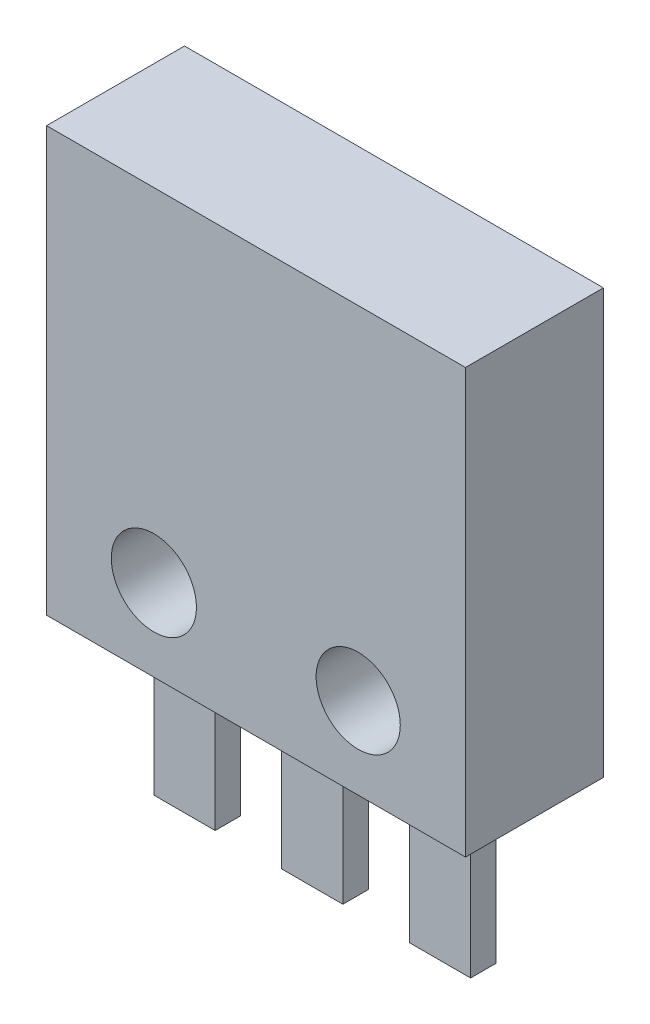
ISO-10303-21;
HEADER;
FILE_DESCRIPTION(('STEP AP214'),'2;1');
FILE_NAME('part.step','',(''),(''),'','','');
FILE_SCHEMA(('AUTOMOTIVE_DESIGN { 1 0 10303 214 1 1 1 1 }'));
ENDSEC;
DATA;
#1=APPLICATION_CONTEXT('core data for automotive mechanical design processes');
#2=APPLICATION_PROTOCOL_DEFINITION('international standard','automotive_design',2000,#1);
#3=PRODUCT_CONTEXT('',#1,'mechanical');
#4=PRODUCT('Part','Part','',(#3));
#5=PRODUCT_RELATED_PRODUCT_CATEGORY('part','',(#4));
#6=PRODUCT_DEFINITION_FORMATION('','',#4);
#7=PRODUCT_DEFINITION_CONTEXT('part definition',#1,'design');
#8=PRODUCT_DEFINITION('design','',#6,#7);
#9=PRODUCT_DEFINITION_SHAPE('','',#8);
#10=(LENGTH_UNIT() NAMED_UNIT(*) SI_UNIT(.MILLI.,.METRE.));
#11=(NAMED_UNIT(*) PLANE_ANGLE_UNIT() SI_UNIT($,.RADIAN.));
#12=(NAMED_UNIT(*) SI_UNIT($,.STERADIAN.) SOLID_ANGLE_UNIT());
#13=UNCERTAINTY_MEASURE_WITH_UNIT(LENGTH_MEASURE(1.E-05),#10,'distance_accuracy_value','');
#14=(GEOMETRIC_REPRESENTATION_CONTEXT(3) GLOBAL_UNCERTAINTY_ASSIGNED_CONTEXT((#13)) GLOBAL_UNIT_ASSIGNED_CONTEXT((#10,
#11,#12)) REPRESENTATION_CONTEXT('',''));
#15=CARTESIAN_POINT('',(0.,0.,0.));
#16=DIRECTION('',(0.,0.,1.));
#17=DIRECTION('',(1.,0.,0.));
#18=AXIS2_PLACEMENT_3D('',#15,#16,#17);
#19=CARTESIAN_POINT('',(0.,0.,1.35));
#20=DIRECTION('',(0.,0.,1.));
#21=DIRECTION('',(1.,0.,0.));
#22=AXIS2_PLACEMENT_3D('',#19,#20,#21);
#23=PLANE('',#22);
#24=CARTESIAN_POINT('',(-2.,-2.55,1.35));
#25=DIRECTION('',(0.,0.,1.));
#26=DIRECTION('',(1.,0.,0.));
#27=AXIS2_PLACEMENT_3D('',#24,#25,#26);
#28=CIRCLE('',#27,0.833443518886286);
#29=CARTESIAN_POINT('',(-1.16655648111371,-2.55,1.35));
#30=VERTEX_POINT('',#29);
#31=EDGE_CURVE('E241',#30,#30,#28,.T.);
#32=ORIENTED_EDGE('',*,*,#31,.F.);
#33=EDGE_LOOP('',(#32));
#34=FACE_BOUND('',#33,.T.);
#35=DIRECTION('',(0.,1.,0.));
#36=VECTOR('',#35,1.);
#37=CARTESIAN_POINT('',(4.1,4.15,1.35));
#38=LINE('',#37,#36);
#39=CARTESIAN_POINT('',(4.1,-4.15,1.35));
#40=VERTEX_POINT('',#39);
#41=CARTESIAN_POINT('',(4.1,4.15,1.35));
#42=VERTEX_POINT('',#41);
#43=EDGE_CURVE('E247',#40,#42,#38,.T.);
#44=ORIENTED_EDGE('',*,*,#43,.T.);
#45=DIRECTION('',(-1.,0.,0.));
#46=VECTOR('',#45,1.);
#47=CARTESIAN_POINT('',(-4.1,4.15,1.35));
#48=LINE('',#47,#46);
#49=CARTESIAN_POINT('',(-4.1,4.15,1.35));
#50=VERTEX_POINT('',#49);
#51=EDGE_CURVE('E250',#42,#50,#48,.T.);
#52=ORIENTED_EDGE('',*,*,#51,.T.);
#53=DIRECTION('',(0.,-1.,0.));
#54=VECTOR('',#53,1.);
#55=CARTESIAN_POINT('',(-4.1,4.15,1.35));
#56=LINE('',#55,#54);
#57=CARTESIAN_POINT('',(-4.1,-4.15,1.35));
#58=VERTEX_POINT('',#57);
#59=EDGE_CURVE('E253',#50,#58,#56,.T.);
#60=ORIENTED_EDGE('',*,*,#59,.T.);
#61=DIRECTION('',(1.,0.,0.));
#62=VECTOR('',#61,1.);
#63=CARTESIAN_POINT('',(-4.1,-4.15,1.35));
#64=LINE('',#63,#62);
#65=EDGE_CURVE('E255',#58,#40,#64,.T.);
#66=ORIENTED_EDGE('',*,*,#65,.T.);
#67=EDGE_LOOP('',(#44,#52,#60,#66));
#68=FACE_BOUND('',#67,.T.);
#69=CARTESIAN_POINT('',(2.,-2.55,1.35));
#70=DIRECTION('',(0.,0.,1.));
#71=DIRECTION('',(1.,0.,0.));
#72=AXIS2_PLACEMENT_3D('',#69,#70,#71);
#73=CIRCLE('',#72,0.82380316392483);
#74=CARTESIAN_POINT('',(2.82380316392483,-2.55,1.35));
#75=VERTEX_POINT('',#74);
#76=EDGE_CURVE('E235',#75,#75,#73,.T.);
#77=ORIENTED_EDGE('',*,*,#76,.F.);
#78=EDGE_LOOP('',(#77));
#79=FACE_BOUND('',#78,.T.);
#80=ADVANCED_FACE('F33',(#34,#68,#79),#23,.T.);
#81=CARTESIAN_POINT('',(0.,0.,-1.35));
#82=DIRECTION('',(0.,0.,1.));
#83=DIRECTION('',(1.,0.,0.));
#84=AXIS2_PLACEMENT_3D('',#81,#82,#83);
#85=PLANE('',#84);
#86=DIRECTION('',(0.,1.,0.));
#87=VECTOR('',#86,1.);
#88=CARTESIAN_POINT('',(4.1,4.15,-1.35));
#89=LINE('',#88,#87);
#90=CARTESIAN_POINT('',(4.1,-4.15,-1.35));
#91=VERTEX_POINT('',#90);
#92=CARTESIAN_POINT('',(4.1,4.15,-1.35));
#93=VERTEX_POINT('',#92);
#94=EDGE_CURVE('E244',#91,#93,#89,.T.);
#95=ORIENTED_EDGE('',*,*,#94,.F.);
#96=DIRECTION('',(1.,0.,0.));
#97=VECTOR('',#96,1.);
#98=CARTESIAN_POINT('',(-4.1,-4.15,-1.35));
#99=LINE('',#98,#97);
#100=CARTESIAN_POINT('',(-4.1,-4.15,-1.35));
#101=VERTEX_POINT('',#100);
#102=EDGE_CURVE('E251',#101,#91,#99,.T.);
#103=ORIENTED_EDGE('',*,*,#102,.F.);
#104=DIRECTION('',(0.,-1.,0.));
#105=VECTOR('',#104,1.);
#106=CARTESIAN_POINT('',(-4.1,4.15,-1.35));
#107=LINE('',#106,#105);
#108=CARTESIAN_POINT('',(-4.1,4.15,-1.35));
#109=VERTEX_POINT('',#108);
#110=EDGE_CURVE('E262',#109,#101,#107,.T.);
#111=ORIENTED_EDGE('',*,*,#110,.F.);
#112=DIRECTION('',(-1.,0.,0.));
#113=VECTOR('',#112,1.);
#114=CARTESIAN_POINT('',(-4.1,4.15,-1.35));
#115=LINE('',#114,#113);
#116=EDGE_CURVE('E260',#93,#109,#115,.T.);
#117=ORIENTED_EDGE('',*,*,#116,.F.);
#118=EDGE_LOOP('',(#95,#103,#111,#117));
#119=FACE_BOUND('',#118,.T.);
#120=CARTESIAN_POINT('',(-2.,-2.55,-1.35));
#121=DIRECTION('',(0.,0.,1.));
#122=DIRECTION('',(1.,0.,0.));
#123=AXIS2_PLACEMENT_3D('',#120,#121,#122);
#124=CIRCLE('',#123,0.833443518886286);
#125=CARTESIAN_POINT('',(-1.16655648111371,-2.55,-1.35));
#126=VERTEX_POINT('',#125);
#127=EDGE_CURVE('E238',#126,#126,#124,.T.);
#128=ORIENTED_EDGE('',*,*,#127,.T.);
#129=EDGE_LOOP('',(#128));
#130=FACE_BOUND('',#129,.T.);
#131=CARTESIAN_POINT('',(2.,-2.55,-1.35));
#132=DIRECTION('',(0.,0.,1.));
#133=DIRECTION('',(1.,0.,0.));
#134=AXIS2_PLACEMENT_3D('',#131,#132,#133);
#135=CIRCLE('',#134,0.82380316392483);
#136=CARTESIAN_POINT('',(2.82380316392483,-2.55,-1.35));
#137=VERTEX_POINT('',#136);
#138=EDGE_CURVE('E234',#137,#137,#135,.T.);
#139=ORIENTED_EDGE('',*,*,#138,.T.);
#140=EDGE_LOOP('',(#139));
#141=FACE_BOUND('',#140,.T.);
#142=ADVANCED_FACE('F280',(#119,#130,#141),#85,.F.);
#143=CARTESIAN_POINT('',(4.1,4.15,1.35));
#144=DIRECTION('',(-1.,0.,0.));
#145=DIRECTION('',(0.,0.,1.));
#146=AXIS2_PLACEMENT_3D('',#143,#144,#145);
#147=PLANE('',#146);
#148=ORIENTED_EDGE('',*,*,#94,.T.);
#149=DIRECTION('',(0.,0.,-1.));
#150=VECTOR('',#149,1.);
#151=CARTESIAN_POINT('',(4.1,4.15,1.35));
#152=LINE('',#151,#150);
#153=EDGE_CURVE('E11',#42,#93,#152,.T.);
#154=ORIENTED_EDGE('',*,*,#153,.F.);
#155=ORIENTED_EDGE('',*,*,#43,.F.);
#156=DIRECTION('',(0.,0.,-1.));
#157=VECTOR('',#156,1.);
#158=CARTESIAN_POINT('',(4.1,-4.15,1.35));
#159=LINE('',#158,#157);
#160=EDGE_CURVE('E257',#40,#91,#159,.T.);
#161=ORIENTED_EDGE('',*,*,#160,.T.);
#162=EDGE_LOOP('',(#148,#154,#155,#161));
#163=FACE_BOUND('',#162,.T.);
#164=ADVANCED_FACE('F35',(#163),#147,.F.);
#165=CARTESIAN_POINT('',(-4.1,4.15,1.35));
#166=DIRECTION('',(0.,-1.,0.));
#167=DIRECTION('',(0.,0.,-1.));
#168=AXIS2_PLACEMENT_3D('',#165,#166,#167);
#169=PLANE('',#168);
#170=ORIENTED_EDGE('',*,*,#116,.T.);
#171=DIRECTION('',(0.,0.,-1.));
#172=VECTOR('',#171,1.);
#173=CARTESIAN_POINT('',(-4.1,4.15,1.35));
#174=LINE('',#173,#172);
#175=EDGE_CURVE('E41',#50,#109,#174,.T.);
#176=ORIENTED_EDGE('',*,*,#175,.F.);
#177=ORIENTED_EDGE('',*,*,#51,.F.);
#178=ORIENTED_EDGE('',*,*,#153,.T.);
#179=EDGE_LOOP('',(#170,#176,#177,#178));
#180=FACE_BOUND('',#179,.T.);
#181=ADVANCED_FACE('F291',(#180),#169,.F.);
#182=CARTESIAN_POINT('',(-4.1,4.15,1.35));
#183=DIRECTION('',(1.,0.,0.));
#184=DIRECTION('',(0.,0.,-1.));
#185=AXIS2_PLACEMENT_3D('',#182,#183,#184);
#186=PLANE('',#185);
#187=ORIENTED_EDGE('',*,*,#110,.T.);
#188=DIRECTION('',(0.,0.,-1.));
#189=VECTOR('',#188,1.);
#190=CARTESIAN_POINT('',(-4.1,-4.15,1.35));
#191=LINE('',#190,#189);
#192=EDGE_CURVE('E267',#58,#101,#191,.T.);
#193=ORIENTED_EDGE('',*,*,#192,.F.);
#194=ORIENTED_EDGE('',*,*,#59,.F.);
#195=ORIENTED_EDGE('',*,*,#175,.T.);
#196=EDGE_LOOP('',(#187,#193,#194,#195));
#197=FACE_BOUND('',#196,.T.);
#198=ADVANCED_FACE('F274',(#197),#186,.F.);
#199=CARTESIAN_POINT('',(-4.1,-4.15,1.35));
#200=DIRECTION('',(0.,1.,0.));
#201=DIRECTION('',(0.,0.,1.));
#202=AXIS2_PLACEMENT_3D('',#199,#200,#201);
#203=PLANE('',#202);
#204=DIRECTION('',(0.,0.,-1.));
#205=VECTOR('',#204,1.);
#206=CARTESIAN_POINT('',(-3.1,-4.15,0.25));
#207=LINE('',#206,#205);
#208=CARTESIAN_POINT('',(-3.1,-4.15,0.25));
#209=VERTEX_POINT('',#208);
#210=CARTESIAN_POINT('',(-3.1,-4.15,-0.25));
#211=VERTEX_POINT('',#210);
#212=EDGE_CURVE('E48',#209,#211,#207,.T.);
#213=ORIENTED_EDGE('',*,*,#212,.F.);
#214=DIRECTION('',(-1.,0.,0.));
#215=VECTOR('',#214,1.);
#216=CARTESIAN_POINT('',(-3.1,-4.15,0.25));
#217=LINE('',#216,#215);
#218=CARTESIAN_POINT('',(-1.9,-4.15,0.25));
#219=VERTEX_POINT('',#218);
#220=EDGE_CURVE('E52',#219,#209,#217,.T.);
#221=ORIENTED_EDGE('',*,*,#220,.F.);
#222=DIRECTION('',(0.,0.,-1.));
#223=VECTOR('',#222,1.);
#224=CARTESIAN_POINT('',(-1.9,-4.15,0.25));
#225=LINE('',#224,#223);
#226=CARTESIAN_POINT('',(-1.9,-4.15,-0.25));
#227=VERTEX_POINT('',#226);
#228=EDGE_CURVE('E170',#219,#227,#225,.T.);
#229=ORIENTED_EDGE('',*,*,#228,.T.);
#230=DIRECTION('',(-1.,0.,0.));
#231=VECTOR('',#230,1.);
#232=CARTESIAN_POINT('',(-3.1,-4.15,-0.25));
#233=LINE('',#232,#231);
#234=EDGE_CURVE('E160',#227,#211,#233,.T.);
#235=ORIENTED_EDGE('',*,*,#234,.T.);
#236=EDGE_LOOP('',(#213,#221,#229,#235));
#237=FACE_BOUND('',#236,.T.);
#238=DIRECTION('',(0.,0.,-1.));
#239=VECTOR('',#238,1.);
#240=CARTESIAN_POINT('',(1.9,-4.15,0.25));
#241=LINE('',#240,#239);
#242=CARTESIAN_POINT('',(1.9,-4.15,0.25));
#243=VERTEX_POINT('',#242);
#244=CARTESIAN_POINT('',(1.9,-4.15,-0.25));
#245=VERTEX_POINT('',#244);
#246=EDGE_CURVE('E185',#243,#245,#241,.T.);
#247=ORIENTED_EDGE('',*,*,#246,.F.);
#248=DIRECTION('',(-1.,0.,0.));
#249=VECTOR('',#248,1.);
#250=CARTESIAN_POINT('',(1.9,-4.15,0.25));
#251=LINE('',#250,#249);
#252=CARTESIAN_POINT('',(3.1,-4.15,0.25));
#253=VERTEX_POINT('',#252);
#254=EDGE_CURVE('E183',#253,#243,#251,.T.);
#255=ORIENTED_EDGE('',*,*,#254,.F.);
#256=DIRECTION('',(0.,0.,-1.));
#257=VECTOR('',#256,1.);
#258=CARTESIAN_POINT('',(3.1,-4.15,0.25));
#259=LINE('',#258,#257);
#260=CARTESIAN_POINT('',(3.1,-4.15,-0.25));
#261=VERTEX_POINT('',#260);
#262=EDGE_CURVE('E194',#253,#261,#259,.T.);
#263=ORIENTED_EDGE('',*,*,#262,.T.);
#264=DIRECTION('',(-1.,0.,0.));
#265=VECTOR('',#264,1.);
#266=CARTESIAN_POINT('',(1.9,-4.15,-0.25));
#267=LINE('',#266,#265);
#268=EDGE_CURVE('E178',#261,#245,#267,.T.);
#269=ORIENTED_EDGE('',*,*,#268,.T.);
#270=EDGE_LOOP('',(#247,#255,#263,#269));
#271=FACE_BOUND('',#270,.T.);
#272=DIRECTION('',(0.,0.,-1.));
#273=VECTOR('',#272,1.);
#274=CARTESIAN_POINT('',(-0.6,-4.15,0.25));
#275=LINE('',#274,#273);
#276=CARTESIAN_POINT('',(-0.6,-4.15,0.25));
#277=VERTEX_POINT('',#276);
#278=CARTESIAN_POINT('',(-0.6,-4.15,-0.25));
#279=VERTEX_POINT('',#278);
#280=EDGE_CURVE('E215',#277,#279,#275,.T.);
#281=ORIENTED_EDGE('',*,*,#280,.F.);
#282=DIRECTION('',(-1.,0.,0.));
#283=VECTOR('',#282,1.);
#284=CARTESIAN_POINT('',(-0.6,-4.15,0.25));
#285=LINE('',#284,#283);
#286=CARTESIAN_POINT('',(0.6,-4.15,0.25));
#287=VERTEX_POINT('',#286);
#288=EDGE_CURVE('E212',#287,#277,#285,.T.);
#289=ORIENTED_EDGE('',*,*,#288,.F.);
#290=DIRECTION('',(0.,0.,-1.));
#291=VECTOR('',#290,1.);
#292=CARTESIAN_POINT('',(0.6,-4.15,0.25));
#293=LINE('',#292,#291);
#294=CARTESIAN_POINT('',(0.6,-4.15,-0.25));
#295=VERTEX_POINT('',#294);
#296=EDGE_CURVE('E226',#287,#295,#293,.T.);
#297=ORIENTED_EDGE('',*,*,#296,.T.);
#298=DIRECTION('',(-1.,0.,0.));
#299=VECTOR('',#298,1.);
#300=CARTESIAN_POINT('',(-0.6,-4.15,-0.25));
#301=LINE('',#300,#299);
#302=EDGE_CURVE('E207',#295,#279,#301,.T.);
#303=ORIENTED_EDGE('',*,*,#302,.T.);
#304=EDGE_LOOP('',(#281,#289,#297,#303));
#305=FACE_BOUND('',#304,.T.);
#306=ORIENTED_EDGE('',*,*,#102,.T.);
#307=ORIENTED_EDGE('',*,*,#160,.F.);
#308=ORIENTED_EDGE('',*,*,#65,.F.);
#309=ORIENTED_EDGE('',*,*,#192,.T.);
#310=EDGE_LOOP('',(#306,#307,#308,#309));
#311=FACE_BOUND('',#310,.T.);
#312=ADVANCED_FACE('F284',(#237,#271,#305,#311),#203,.F.);
#313=CARTESIAN_POINT('',(-2.,-2.55,1.35));
#314=DIRECTION('',(0.,0.,-1.));
#315=DIRECTION('',(-1.,0.,0.));
#316=AXIS2_PLACEMENT_3D('',#313,#314,#315);
#317=CYLINDRICAL_SURFACE('',#316,0.833443518886286);
#318=ORIENTED_EDGE('',*,*,#31,.T.);
#319=EDGE_LOOP('',(#318));
#320=FACE_BOUND('',#319,.T.);
#321=ORIENTED_EDGE('',*,*,#127,.F.);
#322=EDGE_LOOP('',(#321));
#323=FACE_BOUND('',#322,.T.);
#324=ADVANCED_FACE('F307',(#320,#323),#317,.F.);
#325=CARTESIAN_POINT('',(2.,-2.55,1.35));
#326=DIRECTION('',(0.,0.,-1.));
#327=DIRECTION('',(-1.,0.,0.));
#328=AXIS2_PLACEMENT_3D('',#325,#326,#327);
#329=CYLINDRICAL_SURFACE('',#328,0.82380316392483);
#330=ORIENTED_EDGE('',*,*,#76,.T.);
#331=EDGE_LOOP('',(#330));
#332=FACE_BOUND('',#331,.T.);
#333=ORIENTED_EDGE('',*,*,#138,.F.);
#334=EDGE_LOOP('',(#333));
#335=FACE_BOUND('',#334,.T.);
#336=ADVANCED_FACE('F314',(#332,#335),#329,.F.);
#337=CARTESIAN_POINT('',(-0.6,-4.15,0.25));
#338=DIRECTION('',(1.,0.,0.));
#339=DIRECTION('',(0.,1.,0.));
#340=AXIS2_PLACEMENT_3D('',#337,#338,#339);
#341=PLANE('',#340);
#342=DIRECTION('',(0.,-1.,0.));
#343=VECTOR('',#342,1.);
#344=CARTESIAN_POINT('',(-0.6,-4.15,-0.25));
#345=LINE('',#344,#343);
#346=CARTESIAN_POINT('',(-0.599999999999999,-7.25,-0.25));
#347=VERTEX_POINT('',#346);
#348=EDGE_CURVE('E202',#279,#347,#345,.T.);
#349=ORIENTED_EDGE('',*,*,#348,.T.);
#350=DIRECTION('',(0.,0.,-1.));
#351=VECTOR('',#350,1.);
#352=CARTESIAN_POINT('',(-0.599999999999999,-7.25,0.25));
#353=LINE('',#352,#351);
#354=CARTESIAN_POINT('',(-0.599999999999999,-7.25,0.25));
#355=VERTEX_POINT('',#354);
#356=EDGE_CURVE('E231',#355,#347,#353,.T.);
#357=ORIENTED_EDGE('',*,*,#356,.F.);
#358=DIRECTION('',(0.,-1.,0.));
#359=VECTOR('',#358,1.);
#360=CARTESIAN_POINT('',(-0.6,-4.15,0.25));
#361=LINE('',#360,#359);
#362=EDGE_CURVE('E203',#277,#355,#361,.T.);
#363=ORIENTED_EDGE('',*,*,#362,.F.);
#364=ORIENTED_EDGE('',*,*,#280,.T.);
#365=EDGE_LOOP('',(#349,#357,#363,#364));
#366=FACE_BOUND('',#365,.T.);
#367=ADVANCED_FACE('F327',(#366),#341,.F.);
#368=CARTESIAN_POINT('',(-0.599999999999999,-7.25,0.25));
#369=DIRECTION('',(0.,1.,0.));
#370=DIRECTION('',(0.,0.,1.));
#371=AXIS2_PLACEMENT_3D('',#368,#369,#370);
#372=PLANE('',#371);
#373=DIRECTION('',(1.,0.,0.));
#374=VECTOR('',#373,1.);
#375=CARTESIAN_POINT('',(-0.599999999999999,-7.25,-0.25));
#376=LINE('',#375,#374);
#377=CARTESIAN_POINT('',(0.599999999999999,-7.25,-0.25));
#378=VERTEX_POINT('',#377);
#379=EDGE_CURVE('E218',#347,#378,#376,.T.);
#380=ORIENTED_EDGE('',*,*,#379,.T.);
#381=DIRECTION('',(0.,0.,-1.));
#382=VECTOR('',#381,1.);
#383=CARTESIAN_POINT('',(0.599999999999999,-7.25,0.25));
#384=LINE('',#383,#382);
#385=CARTESIAN_POINT('',(0.599999999999999,-7.25,0.25));
#386=VERTEX_POINT('',#385);
#387=EDGE_CURVE('E228',#386,#378,#384,.T.);
#388=ORIENTED_EDGE('',*,*,#387,.F.);
#389=DIRECTION('',(1.,0.,0.));
#390=VECTOR('',#389,1.);
#391=CARTESIAN_POINT('',(-0.599999999999999,-7.25,0.25));
#392=LINE('',#391,#390);
#393=EDGE_CURVE('E206',#355,#386,#392,.T.);
#394=ORIENTED_EDGE('',*,*,#393,.F.);
#395=ORIENTED_EDGE('',*,*,#356,.T.);
#396=EDGE_LOOP('',(#380,#388,#394,#395));
#397=FACE_BOUND('',#396,.T.);
#398=ADVANCED_FACE('F329',(#397),#372,.F.);
#399=CARTESIAN_POINT('',(0.6,-4.15,0.25));
#400=DIRECTION('',(-1.,0.,0.));
#401=DIRECTION('',(0.,-1.,0.));
#402=AXIS2_PLACEMENT_3D('',#399,#400,#401);
#403=PLANE('',#402);
#404=DIRECTION('',(0.,1.,0.));
#405=VECTOR('',#404,1.);
#406=CARTESIAN_POINT('',(0.6,-4.15,-0.25));
#407=LINE('',#406,#405);
#408=EDGE_CURVE('E220',#378,#295,#407,.T.);
#409=ORIENTED_EDGE('',*,*,#408,.T.);
#410=ORIENTED_EDGE('',*,*,#296,.F.);
#411=DIRECTION('',(0.,1.,0.));
#412=VECTOR('',#411,1.);
#413=CARTESIAN_POINT('',(0.6,-4.15,0.25));
#414=LINE('',#413,#412);
#415=EDGE_CURVE('E209',#386,#287,#414,.T.);
#416=ORIENTED_EDGE('',*,*,#415,.F.);
#417=ORIENTED_EDGE('',*,*,#387,.T.);
#418=EDGE_LOOP('',(#409,#410,#416,#417));
#419=FACE_BOUND('',#418,.T.);
#420=ADVANCED_FACE('F333',(#419),#403,.F.);
#421=CARTESIAN_POINT('',(0.,0.,0.25));
#422=DIRECTION('',(0.,0.,1.));
#423=DIRECTION('',(1.,0.,0.));
#424=AXIS2_PLACEMENT_3D('',#421,#422,#423);
#425=PLANE('',#424);
#426=ORIENTED_EDGE('',*,*,#362,.T.);
#427=ORIENTED_EDGE('',*,*,#393,.T.);
#428=ORIENTED_EDGE('',*,*,#415,.T.);
#429=ORIENTED_EDGE('',*,*,#288,.T.);
#430=EDGE_LOOP('',(#426,#427,#428,#429));
#431=FACE_BOUND('',#430,.T.);
#432=ADVANCED_FACE('F323',(#431),#425,.T.);
#433=CARTESIAN_POINT('',(0.,0.,-0.25));
#434=DIRECTION('',(0.,0.,1.));
#435=DIRECTION('',(1.,0.,0.));
#436=AXIS2_PLACEMENT_3D('',#433,#434,#435);
#437=PLANE('',#436);
#438=ORIENTED_EDGE('',*,*,#348,.F.);
#439=ORIENTED_EDGE('',*,*,#302,.F.);
#440=ORIENTED_EDGE('',*,*,#408,.F.);
#441=ORIENTED_EDGE('',*,*,#379,.F.);
#442=EDGE_LOOP('',(#438,#439,#440,#441));
#443=FACE_BOUND('',#442,.T.);
#444=ADVANCED_FACE('F335',(#443),#437,.F.);
#445=CARTESIAN_POINT('',(1.9,-4.15,0.25));
#446=DIRECTION('',(1.,0.,0.));
#447=DIRECTION('',(0.,1.,0.));
#448=AXIS2_PLACEMENT_3D('',#445,#446,#447);
#449=PLANE('',#448);
#450=DIRECTION('',(0.,-1.,0.));
#451=VECTOR('',#450,1.);
#452=CARTESIAN_POINT('',(1.9,-4.15,-0.25));
#453=LINE('',#452,#451);
#454=CARTESIAN_POINT('',(1.9,-7.25,-0.25));
#455=VERTEX_POINT('',#454);
#456=EDGE_CURVE('E165',#245,#455,#453,.T.);
#457=ORIENTED_EDGE('',*,*,#456,.T.);
#458=DIRECTION('',(0.,0.,-1.));
#459=VECTOR('',#458,1.);
#460=CARTESIAN_POINT('',(1.9,-7.25,0.25));
#461=LINE('',#460,#459);
#462=CARTESIAN_POINT('',(1.9,-7.25,0.25));
#463=VERTEX_POINT('',#462);
#464=EDGE_CURVE('E199',#463,#455,#461,.T.);
#465=ORIENTED_EDGE('',*,*,#464,.F.);
#466=DIRECTION('',(0.,-1.,0.));
#467=VECTOR('',#466,1.);
#468=CARTESIAN_POINT('',(1.9,-4.15,0.25));
#469=LINE('',#468,#467);
#470=EDGE_CURVE('E174',#243,#463,#469,.T.);
#471=ORIENTED_EDGE('',*,*,#470,.F.);
#472=ORIENTED_EDGE('',*,*,#246,.T.);
#473=EDGE_LOOP('',(#457,#465,#471,#472));
#474=FACE_BOUND('',#473,.T.);
#475=ADVANCED_FACE('F337',(#474),#449,.F.);
#476=CARTESIAN_POINT('',(1.9,-7.25,0.25));
#477=DIRECTION('',(0.,1.,0.));
#478=DIRECTION('',(0.,0.,1.));
#479=AXIS2_PLACEMENT_3D('',#476,#477,#478);
#480=PLANE('',#479);
#481=DIRECTION('',(1.,0.,0.));
#482=VECTOR('',#481,1.);
#483=CARTESIAN_POINT('',(1.9,-7.25,-0.25));
#484=LINE('',#483,#482);
#485=CARTESIAN_POINT('',(3.1,-7.25,-0.25));
#486=VERTEX_POINT('',#485);
#487=EDGE_CURVE('E168',#455,#486,#484,.T.);
#488=ORIENTED_EDGE('',*,*,#487,.T.);
#489=DIRECTION('',(0.,0.,-1.));
#490=VECTOR('',#489,1.);
#491=CARTESIAN_POINT('',(3.1,-7.25,0.25));
#492=LINE('',#491,#490);
#493=CARTESIAN_POINT('',(3.1,-7.25,0.25));
#494=VERTEX_POINT('',#493);
#495=EDGE_CURVE('E196',#494,#486,#492,.T.);
#496=ORIENTED_EDGE('',*,*,#495,.F.);
#497=DIRECTION('',(1.,0.,0.));
#498=VECTOR('',#497,1.);
#499=CARTESIAN_POINT('',(1.9,-7.25,0.25));
#500=LINE('',#499,#498);
#501=EDGE_CURVE('E177',#463,#494,#500,.T.);
#502=ORIENTED_EDGE('',*,*,#501,.F.);
#503=ORIENTED_EDGE('',*,*,#464,.T.);
#504=EDGE_LOOP('',(#488,#496,#502,#503));
#505=FACE_BOUND('',#504,.T.);
#506=ADVANCED_FACE('F343',(#505),#480,.F.);
#507=CARTESIAN_POINT('',(3.1,-4.15,0.25));
#508=DIRECTION('',(-1.,0.,0.));
#509=DIRECTION('',(0.,0.,1.));
#510=AXIS2_PLACEMENT_3D('',#507,#508,#509);
#511=PLANE('',#510);
#512=DIRECTION('',(0.,1.,0.));
#513=VECTOR('',#512,1.);
#514=CARTESIAN_POINT('',(3.1,-4.15,-0.25));
#515=LINE('',#514,#513);
#516=EDGE_CURVE('E188',#486,#261,#515,.T.);
#517=ORIENTED_EDGE('',*,*,#516,.T.);
#518=ORIENTED_EDGE('',*,*,#262,.F.);
#519=DIRECTION('',(0.,1.,0.));
#520=VECTOR('',#519,1.);
#521=CARTESIAN_POINT('',(3.1,-4.15,0.25));
#522=LINE('',#521,#520);
#523=EDGE_CURVE('E180',#494,#253,#522,.T.);
#524=ORIENTED_EDGE('',*,*,#523,.F.);
#525=ORIENTED_EDGE('',*,*,#495,.T.);
#526=EDGE_LOOP('',(#517,#518,#524,#525));
#527=FACE_BOUND('',#526,.T.);
#528=ADVANCED_FACE('F398',(#527),#511,.F.);
#529=CARTESIAN_POINT('',(0.,0.,0.25));
#530=DIRECTION('',(0.,0.,1.));
#531=DIRECTION('',(1.,0.,0.));
#532=AXIS2_PLACEMENT_3D('',#529,#530,#531);
#533=PLANE('',#532);
#534=ORIENTED_EDGE('',*,*,#470,.T.);
#535=ORIENTED_EDGE('',*,*,#501,.T.);
#536=ORIENTED_EDGE('',*,*,#523,.T.);
#537=ORIENTED_EDGE('',*,*,#254,.T.);
#538=EDGE_LOOP('',(#534,#535,#536,#537));
#539=FACE_BOUND('',#538,.T.);
#540=ADVANCED_FACE('F408',(#539),#533,.T.);
#541=CARTESIAN_POINT('',(0.,0.,-0.25));
#542=DIRECTION('',(0.,0.,1.));
#543=DIRECTION('',(1.,0.,0.));
#544=AXIS2_PLACEMENT_3D('',#541,#542,#543);
#545=PLANE('',#544);
#546=ORIENTED_EDGE('',*,*,#456,.F.);
#547=ORIENTED_EDGE('',*,*,#268,.F.);
#548=ORIENTED_EDGE('',*,*,#516,.F.);
#549=ORIENTED_EDGE('',*,*,#487,.F.);
#550=EDGE_LOOP('',(#546,#547,#548,#549));
#551=FACE_BOUND('',#550,.T.);
#552=ADVANCED_FACE('F418',(#551),#545,.F.);
#553=CARTESIAN_POINT('',(-3.1,-4.15,0.25));
#554=DIRECTION('',(1.,0.,0.));
#555=DIRECTION('',(0.,0.,-1.));
#556=AXIS2_PLACEMENT_3D('',#553,#554,#555);
#557=PLANE('',#556);
#558=DIRECTION('',(0.,-1.,0.));
#559=VECTOR('',#558,1.);
#560=CARTESIAN_POINT('',(-3.1,-4.15,-0.25));
#561=LINE('',#560,#559);
#562=CARTESIAN_POINT('',(-3.1,-7.25,-0.25));
#563=VERTEX_POINT('',#562);
#564=EDGE_CURVE('E164',#211,#563,#561,.T.);
#565=ORIENTED_EDGE('',*,*,#564,.T.);
#566=DIRECTION('',(0.,0.,-1.));
#567=VECTOR('',#566,1.);
#568=CARTESIAN_POINT('',(-3.1,-7.25,0.25));
#569=LINE('',#568,#567);
#570=CARTESIAN_POINT('',(-3.1,-7.25,0.25));
#571=VERTEX_POINT('',#570);
#572=EDGE_CURVE('E148',#571,#563,#569,.T.);
#573=ORIENTED_EDGE('',*,*,#572,.F.);
#574=DIRECTION('',(0.,-1.,0.));
#575=VECTOR('',#574,1.);
#576=CARTESIAN_POINT('',(-3.1,-4.15,0.25));
#577=LINE('',#576,#575);
#578=EDGE_CURVE('E155',#209,#571,#577,.T.);
#579=ORIENTED_EDGE('',*,*,#578,.F.);
#580=ORIENTED_EDGE('',*,*,#212,.T.);
#581=EDGE_LOOP('',(#565,#573,#579,#580));
#582=FACE_BOUND('',#581,.T.);
#583=ADVANCED_FACE('F162',(#582),#557,.F.);
#584=CARTESIAN_POINT('',(-3.1,-7.25,0.25));
#585=DIRECTION('',(0.,1.,0.));
#586=DIRECTION('',(0.,0.,1.));
#587=AXIS2_PLACEMENT_3D('',#584,#585,#586);
#588=PLANE('',#587);
#589=DIRECTION('',(1.,0.,0.));
#590=VECTOR('',#589,1.);
#591=CARTESIAN_POINT('',(-3.1,-7.25,-0.25));
#592=LINE('',#591,#590);
#593=CARTESIAN_POINT('',(-1.9,-7.25,-0.25));
#594=VERTEX_POINT('',#593);
#595=EDGE_CURVE('E478',#563,#594,#592,.T.);
#596=ORIENTED_EDGE('',*,*,#595,.T.);
#597=DIRECTION('',(0.,0.,-1.));
#598=VECTOR('',#597,1.);
#599=CARTESIAN_POINT('',(-1.9,-7.25,0.25));
#600=LINE('',#599,#598);
#601=CARTESIAN_POINT('',(-1.9,-7.25,0.25));
#602=VERTEX_POINT('',#601);
#603=EDGE_CURVE('E151',#602,#594,#600,.T.);
#604=ORIENTED_EDGE('',*,*,#603,.F.);
#605=DIRECTION('',(1.,0.,0.));
#606=VECTOR('',#605,1.);
#607=CARTESIAN_POINT('',(-3.1,-7.25,0.25));
#608=LINE('',#607,#606);
#609=EDGE_CURVE('E144',#571,#602,#608,.T.);
#610=ORIENTED_EDGE('',*,*,#609,.F.);
#611=ORIENTED_EDGE('',*,*,#572,.T.);
#612=EDGE_LOOP('',(#596,#604,#610,#611));
#613=FACE_BOUND('',#612,.T.);
#614=ADVANCED_FACE('F146',(#613),#588,.F.);
#615=CARTESIAN_POINT('',(-1.9,-4.15,0.25));
#616=DIRECTION('',(-1.,0.,0.));
#617=DIRECTION('',(0.,0.,1.));
#618=AXIS2_PLACEMENT_3D('',#615,#616,#617);
#619=PLANE('',#618);
#620=DIRECTION('',(0.,1.,0.));
#621=VECTOR('',#620,1.);
#622=CARTESIAN_POINT('',(-1.9,-4.15,-0.25));
#623=LINE('',#622,#621);
#624=EDGE_CURVE('E480',#594,#227,#623,.T.);
#625=ORIENTED_EDGE('',*,*,#624,.T.);
#626=ORIENTED_EDGE('',*,*,#228,.F.);
#627=DIRECTION('',(0.,1.,0.));
#628=VECTOR('',#627,1.);
#629=CARTESIAN_POINT('',(-1.9,-4.15,0.25));
#630=LINE('',#629,#628);
#631=EDGE_CURVE('E154',#602,#219,#630,.T.);
#632=ORIENTED_EDGE('',*,*,#631,.F.);
#633=ORIENTED_EDGE('',*,*,#603,.T.);
#634=EDGE_LOOP('',(#625,#626,#632,#633));
#635=FACE_BOUND('',#634,.T.);
#636=ADVANCED_FACE('F445',(#635),#619,.F.);
#637=CARTESIAN_POINT('',(0.,0.,0.25));
#638=DIRECTION('',(0.,0.,1.));
#639=DIRECTION('',(1.,0.,0.));
#640=AXIS2_PLACEMENT_3D('',#637,#638,#639);
#641=PLANE('',#640);
#642=ORIENTED_EDGE('',*,*,#578,.T.);
#643=ORIENTED_EDGE('',*,*,#609,.T.);
#644=ORIENTED_EDGE('',*,*,#631,.T.);
#645=ORIENTED_EDGE('',*,*,#220,.T.);
#646=EDGE_LOOP('',(#642,#643,#644,#645));
#647=FACE_BOUND('',#646,.T.);
#648=ADVANCED_FACE('F158',(#647),#641,.T.);
#649=CARTESIAN_POINT('',(0.,0.,-0.25));
#650=DIRECTION('',(0.,0.,1.));
#651=DIRECTION('',(1.,0.,0.));
#652=AXIS2_PLACEMENT_3D('',#649,#650,#651);
#653=PLANE('',#652);
#654=ORIENTED_EDGE('',*,*,#564,.F.);
#655=ORIENTED_EDGE('',*,*,#234,.F.);
#656=ORIENTED_EDGE('',*,*,#624,.F.);
#657=ORIENTED_EDGE('',*,*,#595,.F.);
#658=EDGE_LOOP('',(#654,#655,#656,#657));
#659=FACE_BOUND('',#658,.T.);
#660=ADVANCED_FACE('F463',(#659),#653,.F.);
#661=CLOSED_SHELL('',(#80,#142,#164,#181,#198,#312,#324,#336,#367,#398,#420,#432,#444,#475,#506,
#528,#540,#552,#583,#614,#636,#648,#660));
#662=MANIFOLD_SOLID_BREP('B2',#661);
#663=ADVANCED_BREP_SHAPE_REPRESENTATION('',(#18,#662),#14);
#664=SHAPE_DEFINITION_REPRESENTATION(#9,#663);
ENDSEC;
END-ISO-10303-21;
